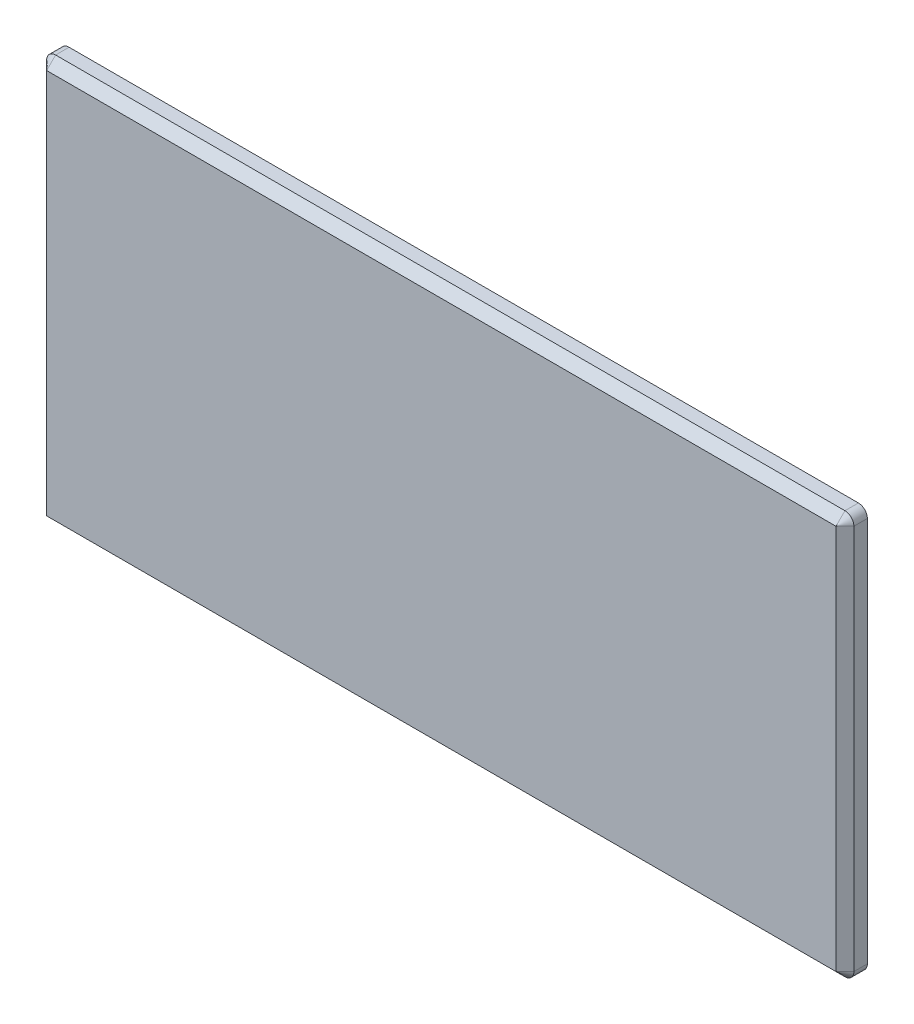
ISO-10303-21;
HEADER;
FILE_DESCRIPTION(('STEP AP214'),'2;1');
FILE_NAME('part.step','',(''),(''),'','','');
FILE_SCHEMA(('AUTOMOTIVE_DESIGN { 1 0 10303 214 1 1 1 1 }'));
ENDSEC;
DATA;
#1=APPLICATION_CONTEXT('core data for automotive mechanical design processes');
#2=APPLICATION_PROTOCOL_DEFINITION('international standard','automotive_design',2000,#1);
#3=PRODUCT_CONTEXT('',#1,'mechanical');
#4=PRODUCT('Part','Part','',(#3));
#5=PRODUCT_RELATED_PRODUCT_CATEGORY('part','',(#4));
#6=PRODUCT_DEFINITION_FORMATION('','',#4);
#7=PRODUCT_DEFINITION_CONTEXT('part definition',#1,'design');
#8=PRODUCT_DEFINITION('design','',#6,#7);
#9=PRODUCT_DEFINITION_SHAPE('','',#8);
#10=(LENGTH_UNIT() NAMED_UNIT(*) SI_UNIT(.MILLI.,.METRE.));
#11=(NAMED_UNIT(*) PLANE_ANGLE_UNIT() SI_UNIT($,.RADIAN.));
#12=(NAMED_UNIT(*) SI_UNIT($,.STERADIAN.) SOLID_ANGLE_UNIT());
#13=UNCERTAINTY_MEASURE_WITH_UNIT(LENGTH_MEASURE(1.E-05),#10,'distance_accuracy_value','');
#14=(GEOMETRIC_REPRESENTATION_CONTEXT(3) GLOBAL_UNCERTAINTY_ASSIGNED_CONTEXT((#13)) GLOBAL_UNIT_ASSIGNED_CONTEXT((#10,
#11,#12)) REPRESENTATION_CONTEXT('',''));
#15=CARTESIAN_POINT('',(0.,0.,0.));
#16=DIRECTION('',(0.,0.,1.));
#17=DIRECTION('',(1.,0.,0.));
#18=AXIS2_PLACEMENT_3D('',#15,#16,#17);
#19=CARTESIAN_POINT('',(45.,-22.5,2.5));
#20=DIRECTION('',(-1.,0.,0.));
#21=DIRECTION('',(0.,0.,1.));
#22=AXIS2_PLACEMENT_3D('',#19,#20,#21);
#23=PLANE('',#22);
#24=DIRECTION('',(0.,0.,-1.));
#25=VECTOR('',#24,1.);
#26=CARTESIAN_POINT('',(45.,21.5,2.5));
#27=LINE('',#26,#25);
#28=CARTESIAN_POINT('',(45.,21.5,0.));
#29=VERTEX_POINT('',#28);
#30=CARTESIAN_POINT('',(45.,21.5,1.5));
#31=VERTEX_POINT('',#30);
#32=EDGE_CURVE('E152',#29,#31,#27,.F.);
#33=ORIENTED_EDGE('',*,*,#32,.T.);
#34=DIRECTION('',(0.,-1.,0.));
#35=VECTOR('',#34,1.);
#36=CARTESIAN_POINT('',(45.,-22.5,1.5));
#37=LINE('',#36,#35);
#38=CARTESIAN_POINT('',(45.,-21.5,1.5));
#39=VERTEX_POINT('',#38);
#40=EDGE_CURVE('E171',#31,#39,#37,.T.);
#41=ORIENTED_EDGE('',*,*,#40,.T.);
#42=DIRECTION('',(0.,0.,-1.));
#43=VECTOR('',#42,1.);
#44=CARTESIAN_POINT('',(45.,-21.5,2.5));
#45=LINE('',#44,#43);
#46=CARTESIAN_POINT('',(45.,-21.5,0.));
#47=VERTEX_POINT('',#46);
#48=EDGE_CURVE('E150',#39,#47,#45,.T.);
#49=ORIENTED_EDGE('',*,*,#48,.T.);
#50=DIRECTION('',(0.,1.,0.));
#51=VECTOR('',#50,1.);
#52=CARTESIAN_POINT('',(45.,-22.5,0.));
#53=LINE('',#52,#51);
#54=EDGE_CURVE('E200',#47,#29,#53,.T.);
#55=ORIENTED_EDGE('',*,*,#54,.T.);
#56=EDGE_LOOP('',(#33,#41,#49,#55));
#57=FACE_BOUND('',#56,.T.);
#58=ADVANCED_FACE('F33',(#57),#23,.F.);
#59=CARTESIAN_POINT('',(-45.,22.5,2.5));
#60=DIRECTION('',(0.,-1.,0.));
#61=DIRECTION('',(0.,0.,-1.));
#62=AXIS2_PLACEMENT_3D('',#59,#60,#61);
#63=PLANE('',#62);
#64=DIRECTION('',(0.,0.,-1.));
#65=VECTOR('',#64,1.);
#66=CARTESIAN_POINT('',(-44.,22.5,2.5));
#67=LINE('',#66,#65);
#68=CARTESIAN_POINT('',(-44.,22.5,0.));
#69=VERTEX_POINT('',#68);
#70=CARTESIAN_POINT('',(-44.,22.5,1.5));
#71=VERTEX_POINT('',#70);
#72=EDGE_CURVE('E147',#69,#71,#67,.F.);
#73=ORIENTED_EDGE('',*,*,#72,.T.);
#74=DIRECTION('',(1.,0.,0.));
#75=VECTOR('',#74,1.);
#76=CARTESIAN_POINT('',(-45.,22.5,1.5));
#77=LINE('',#76,#75);
#78=CARTESIAN_POINT('',(44.,22.5,1.5));
#79=VERTEX_POINT('',#78);
#80=EDGE_CURVE('E167',#71,#79,#77,.T.);
#81=ORIENTED_EDGE('',*,*,#80,.T.);
#82=DIRECTION('',(0.,0.,-1.));
#83=VECTOR('',#82,1.);
#84=CARTESIAN_POINT('',(44.,22.5,2.5));
#85=LINE('',#84,#83);
#86=CARTESIAN_POINT('',(44.,22.5,0.));
#87=VERTEX_POINT('',#86);
#88=EDGE_CURVE('E145',#79,#87,#85,.T.);
#89=ORIENTED_EDGE('',*,*,#88,.T.);
#90=DIRECTION('',(-1.,0.,0.));
#91=VECTOR('',#90,1.);
#92=CARTESIAN_POINT('',(-45.,22.5,0.));
#93=LINE('',#92,#91);
#94=EDGE_CURVE('E135',#87,#69,#93,.T.);
#95=ORIENTED_EDGE('',*,*,#94,.T.);
#96=EDGE_LOOP('',(#73,#81,#89,#95));
#97=FACE_BOUND('',#96,.T.);
#98=ADVANCED_FACE('F254',(#97),#63,.F.);
#99=CARTESIAN_POINT('',(-45.,-22.5,2.5));
#100=DIRECTION('',(1.,0.,0.));
#101=DIRECTION('',(0.,0.,-1.));
#102=AXIS2_PLACEMENT_3D('',#99,#100,#101);
#103=PLANE('',#102);
#104=DIRECTION('',(0.,0.,-1.));
#105=VECTOR('',#104,1.);
#106=CARTESIAN_POINT('',(-45.,-21.5,2.5));
#107=LINE('',#106,#105);
#108=CARTESIAN_POINT('',(-45.,-21.5,0.));
#109=VERTEX_POINT('',#108);
#110=CARTESIAN_POINT('',(-45.,-21.5,1.5));
#111=VERTEX_POINT('',#110);
#112=EDGE_CURVE('E122',#109,#111,#107,.F.);
#113=ORIENTED_EDGE('',*,*,#112,.T.);
#114=DIRECTION('',(0.,1.,0.));
#115=VECTOR('',#114,1.);
#116=CARTESIAN_POINT('',(-45.,-22.5,1.5));
#117=LINE('',#116,#115);
#118=CARTESIAN_POINT('',(-45.,21.5,1.5));
#119=VERTEX_POINT('',#118);
#120=EDGE_CURVE('E11',#111,#119,#117,.T.);
#121=ORIENTED_EDGE('',*,*,#120,.T.);
#122=DIRECTION('',(0.,0.,-1.));
#123=VECTOR('',#122,1.);
#124=CARTESIAN_POINT('',(-45.,21.5,2.5));
#125=LINE('',#124,#123);
#126=CARTESIAN_POINT('',(-45.,21.5,0.));
#127=VERTEX_POINT('',#126);
#128=EDGE_CURVE('E126',#119,#127,#125,.T.);
#129=ORIENTED_EDGE('',*,*,#128,.T.);
#130=DIRECTION('',(0.,-1.,0.));
#131=VECTOR('',#130,1.);
#132=CARTESIAN_POINT('',(-45.,-22.5,0.));
#133=LINE('',#132,#131);
#134=EDGE_CURVE('E132',#127,#109,#133,.T.);
#135=ORIENTED_EDGE('',*,*,#134,.T.);
#136=EDGE_LOOP('',(#113,#121,#129,#135));
#137=FACE_BOUND('',#136,.T.);
#138=ADVANCED_FACE('F259',(#137),#103,.F.);
#139=CARTESIAN_POINT('',(-45.,-22.5,2.5));
#140=DIRECTION('',(0.,1.,0.));
#141=DIRECTION('',(0.,0.,1.));
#142=AXIS2_PLACEMENT_3D('',#139,#140,#141);
#143=PLANE('',#142);
#144=DIRECTION('',(0.,0.,-1.));
#145=VECTOR('',#144,1.);
#146=CARTESIAN_POINT('',(44.,-22.5,2.5));
#147=LINE('',#146,#145);
#148=CARTESIAN_POINT('',(44.,-22.5,0.));
#149=VERTEX_POINT('',#148);
#150=CARTESIAN_POINT('',(44.,-22.5,1.5));
#151=VERTEX_POINT('',#150);
#152=EDGE_CURVE('E118',#149,#151,#147,.F.);
#153=ORIENTED_EDGE('',*,*,#152,.T.);
#154=DIRECTION('',(-1.,0.,0.));
#155=VECTOR('',#154,1.);
#156=CARTESIAN_POINT('',(-45.,-22.5,1.5));
#157=LINE('',#156,#155);
#158=CARTESIAN_POINT('',(-44.,-22.5,1.5));
#159=VERTEX_POINT('',#158);
#160=EDGE_CURVE('E57',#151,#159,#157,.T.);
#161=ORIENTED_EDGE('',*,*,#160,.T.);
#162=DIRECTION('',(0.,0.,-1.));
#163=VECTOR('',#162,1.);
#164=CARTESIAN_POINT('',(-44.,-22.5,2.5));
#165=LINE('',#164,#163);
#166=CARTESIAN_POINT('',(-44.,-22.5,0.));
#167=VERTEX_POINT('',#166);
#168=EDGE_CURVE('E110',#159,#167,#165,.T.);
#169=ORIENTED_EDGE('',*,*,#168,.T.);
#170=DIRECTION('',(1.,0.,0.));
#171=VECTOR('',#170,1.);
#172=CARTESIAN_POINT('',(-45.,-22.5,0.));
#173=LINE('',#172,#171);
#174=EDGE_CURVE('E114',#167,#149,#173,.T.);
#175=ORIENTED_EDGE('',*,*,#174,.T.);
#176=EDGE_LOOP('',(#153,#161,#169,#175));
#177=FACE_BOUND('',#176,.T.);
#178=ADVANCED_FACE('F112',(#177),#143,.F.);
#179=CARTESIAN_POINT('',(0.,0.,2.5));
#180=DIRECTION('',(0.,0.,-1.));
#181=DIRECTION('',(-1.,0.,0.));
#182=AXIS2_PLACEMENT_3D('',#179,#180,#181);
#183=PLANE('',#182);
#184=DIRECTION('',(0.,1.,0.));
#185=VECTOR('',#184,1.);
#186=CARTESIAN_POINT('',(44.,0.,2.5));
#187=LINE('',#186,#185);
#188=CARTESIAN_POINT('',(44.,-21.5,2.5));
#189=VERTEX_POINT('',#188);
#190=CARTESIAN_POINT('',(44.,21.5,2.5));
#191=VERTEX_POINT('',#190);
#192=EDGE_CURVE('E162',#189,#191,#187,.T.);
#193=ORIENTED_EDGE('',*,*,#192,.T.);
#194=DIRECTION('',(-1.,0.,0.));
#195=VECTOR('',#194,1.);
#196=CARTESIAN_POINT('',(0.,21.5,2.5));
#197=LINE('',#196,#195);
#198=CARTESIAN_POINT('',(-44.,21.5,2.5));
#199=VERTEX_POINT('',#198);
#200=EDGE_CURVE('E164',#191,#199,#197,.T.);
#201=ORIENTED_EDGE('',*,*,#200,.T.);
#202=DIRECTION('',(0.,-1.,0.));
#203=VECTOR('',#202,1.);
#204=CARTESIAN_POINT('',(-44.,0.,2.5));
#205=LINE('',#204,#203);
#206=CARTESIAN_POINT('',(-44.,-21.5,2.5));
#207=VERTEX_POINT('',#206);
#208=EDGE_CURVE('E158',#199,#207,#205,.T.);
#209=ORIENTED_EDGE('',*,*,#208,.T.);
#210=DIRECTION('',(1.,0.,0.));
#211=VECTOR('',#210,1.);
#212=CARTESIAN_POINT('',(0.,-21.5,2.5));
#213=LINE('',#212,#211);
#214=EDGE_CURVE('E160',#207,#189,#213,.T.);
#215=ORIENTED_EDGE('',*,*,#214,.T.);
#216=EDGE_LOOP('',(#193,#201,#209,#215));
#217=FACE_BOUND('',#216,.T.);
#218=ADVANCED_FACE('F233',(#217),#183,.F.);
#219=CARTESIAN_POINT('',(0.,0.,0.));
#220=DIRECTION('',(0.,0.,-1.));
#221=DIRECTION('',(-1.,0.,0.));
#222=AXIS2_PLACEMENT_3D('',#219,#220,#221);
#223=PLANE('',#222);
#224=CARTESIAN_POINT('',(-22.5,0.,0.));
#225=DIRECTION('',(0.,0.,-1.));
#226=DIRECTION('',(-1.,0.,0.));
#227=AXIS2_PLACEMENT_3D('',#224,#225,#226);
#228=CIRCLE('',#227,4.);
#229=CARTESIAN_POINT('',(-26.5,0.,0.));
#230=VERTEX_POINT('',#229);
#231=EDGE_CURVE('E216',#230,#230,#228,.T.);
#232=ORIENTED_EDGE('',*,*,#231,.F.);
#233=EDGE_LOOP('',(#232));
#234=FACE_BOUND('',#233,.T.);
#235=CARTESIAN_POINT('',(22.5,0.,0.));
#236=DIRECTION('',(0.,0.,-1.));
#237=DIRECTION('',(-1.,0.,0.));
#238=AXIS2_PLACEMENT_3D('',#235,#236,#237);
#239=CIRCLE('',#238,4.);
#240=CARTESIAN_POINT('',(18.5,0.,0.));
#241=VERTEX_POINT('',#240);
#242=EDGE_CURVE('E210',#241,#241,#239,.T.);
#243=ORIENTED_EDGE('',*,*,#242,.F.);
#244=EDGE_LOOP('',(#243));
#245=FACE_BOUND('',#244,.T.);
#246=ORIENTED_EDGE('',*,*,#174,.F.);
#247=CARTESIAN_POINT('',(-44.,-21.5,0.));
#248=DIRECTION('',(0.,0.,-1.));
#249=DIRECTION('',(-1.,0.,0.));
#250=AXIS2_PLACEMENT_3D('',#247,#248,#249);
#251=CIRCLE('',#250,1.);
#252=EDGE_CURVE('E120',#167,#109,#251,.T.);
#253=ORIENTED_EDGE('',*,*,#252,.T.);
#254=ORIENTED_EDGE('',*,*,#134,.F.);
#255=CARTESIAN_POINT('',(-44.,21.5,0.));
#256=DIRECTION('',(0.,0.,-1.));
#257=DIRECTION('',(-1.,0.,0.));
#258=AXIS2_PLACEMENT_3D('',#255,#256,#257);
#259=CIRCLE('',#258,1.);
#260=EDGE_CURVE('E127',#127,#69,#259,.T.);
#261=ORIENTED_EDGE('',*,*,#260,.T.);
#262=ORIENTED_EDGE('',*,*,#94,.F.);
#263=CARTESIAN_POINT('',(44.,21.5,0.));
#264=DIRECTION('',(0.,0.,-1.));
#265=DIRECTION('',(-1.,0.,0.));
#266=AXIS2_PLACEMENT_3D('',#263,#264,#265);
#267=CIRCLE('',#266,1.);
#268=EDGE_CURVE('E140',#87,#29,#267,.T.);
#269=ORIENTED_EDGE('',*,*,#268,.T.);
#270=ORIENTED_EDGE('',*,*,#54,.F.);
#271=CARTESIAN_POINT('',(44.,-21.5,0.));
#272=DIRECTION('',(0.,0.,-1.));
#273=DIRECTION('',(-1.,0.,0.));
#274=AXIS2_PLACEMENT_3D('',#271,#272,#273);
#275=CIRCLE('',#274,1.);
#276=EDGE_CURVE('E117',#47,#149,#275,.T.);
#277=ORIENTED_EDGE('',*,*,#276,.T.);
#278=EDGE_LOOP('',(#246,#253,#254,#261,#262,#269,#270,#277));
#279=FACE_BOUND('',#278,.T.);
#280=ADVANCED_FACE('F129',(#234,#245,#279),#223,.T.);
#281=CARTESIAN_POINT('',(-44.,-21.5,2.5));
#282=DIRECTION('',(0.,0.,-1.));
#283=DIRECTION('',(-1.,0.,0.));
#284=AXIS2_PLACEMENT_3D('',#281,#282,#283);
#285=CYLINDRICAL_SURFACE('',#284,1.);
#286=ORIENTED_EDGE('',*,*,#168,.F.);
#287=CARTESIAN_POINT('',(-44.,-21.5,1.5));
#288=DIRECTION('',(0.,0.,-1.));
#289=DIRECTION('',(-1.,0.,0.));
#290=AXIS2_PLACEMENT_3D('',#287,#288,#289);
#291=CIRCLE('',#290,1.);
#292=EDGE_CURVE('E42',#159,#111,#291,.T.);
#293=ORIENTED_EDGE('',*,*,#292,.T.);
#294=ORIENTED_EDGE('',*,*,#112,.F.);
#295=ORIENTED_EDGE('',*,*,#252,.F.);
#296=EDGE_LOOP('',(#286,#293,#294,#295));
#297=FACE_BOUND('',#296,.T.);
#298=ADVANCED_FACE('F121',(#297),#285,.T.);
#299=CARTESIAN_POINT('',(-44.,21.5,2.5));
#300=DIRECTION('',(0.,0.,-1.));
#301=DIRECTION('',(-1.,0.,0.));
#302=AXIS2_PLACEMENT_3D('',#299,#300,#301);
#303=CYLINDRICAL_SURFACE('',#302,1.);
#304=ORIENTED_EDGE('',*,*,#128,.F.);
#305=CARTESIAN_POINT('',(-44.,21.5,1.5));
#306=DIRECTION('',(0.,0.,-1.));
#307=DIRECTION('',(-1.,0.,0.));
#308=AXIS2_PLACEMENT_3D('',#305,#306,#307);
#309=CIRCLE('',#308,1.);
#310=EDGE_CURVE('E155',#119,#71,#309,.T.);
#311=ORIENTED_EDGE('',*,*,#310,.T.);
#312=ORIENTED_EDGE('',*,*,#72,.F.);
#313=ORIENTED_EDGE('',*,*,#260,.F.);
#314=EDGE_LOOP('',(#304,#311,#312,#313));
#315=FACE_BOUND('',#314,.T.);
#316=ADVANCED_FACE('F266',(#315),#303,.T.);
#317=CARTESIAN_POINT('',(44.,21.5,2.5));
#318=DIRECTION('',(0.,0.,-1.));
#319=DIRECTION('',(-1.,0.,0.));
#320=AXIS2_PLACEMENT_3D('',#317,#318,#319);
#321=CYLINDRICAL_SURFACE('',#320,1.);
#322=ORIENTED_EDGE('',*,*,#88,.F.);
#323=CARTESIAN_POINT('',(44.,21.5,1.5));
#324=DIRECTION('',(0.,0.,-1.));
#325=DIRECTION('',(-1.,0.,0.));
#326=AXIS2_PLACEMENT_3D('',#323,#324,#325);
#327=CIRCLE('',#326,1.);
#328=EDGE_CURVE('E169',#79,#31,#327,.T.);
#329=ORIENTED_EDGE('',*,*,#328,.T.);
#330=ORIENTED_EDGE('',*,*,#32,.F.);
#331=ORIENTED_EDGE('',*,*,#268,.F.);
#332=EDGE_LOOP('',(#322,#329,#330,#331));
#333=FACE_BOUND('',#332,.T.);
#334=ADVANCED_FACE('F269',(#333),#321,.T.);
#335=CARTESIAN_POINT('',(44.,-21.5,2.5));
#336=DIRECTION('',(0.,0.,-1.));
#337=DIRECTION('',(-1.,0.,0.));
#338=AXIS2_PLACEMENT_3D('',#335,#336,#337);
#339=CYLINDRICAL_SURFACE('',#338,1.);
#340=ORIENTED_EDGE('',*,*,#48,.F.);
#341=CARTESIAN_POINT('',(44.,-21.5,1.5));
#342=DIRECTION('',(0.,0.,-1.));
#343=DIRECTION('',(-1.,0.,0.));
#344=AXIS2_PLACEMENT_3D('',#341,#342,#343);
#345=CIRCLE('',#344,1.);
#346=EDGE_CURVE('E173',#39,#151,#345,.T.);
#347=ORIENTED_EDGE('',*,*,#346,.T.);
#348=ORIENTED_EDGE('',*,*,#152,.F.);
#349=ORIENTED_EDGE('',*,*,#276,.F.);
#350=EDGE_LOOP('',(#340,#347,#348,#349));
#351=FACE_BOUND('',#350,.T.);
#352=ADVANCED_FACE('F273',(#351),#339,.T.);
#353=CARTESIAN_POINT('',(44.,-21.5,1.5));
#354=DIRECTION('',(0.,0.,-1.));
#355=DIRECTION('',(-1.,0.,0.));
#356=AXIS2_PLACEMENT_3D('',#353,#354,#355);
#357=CONICAL_SURFACE('',#356,0.999999999999987,0.785398163397442);
#358=DIRECTION('',(0.,0.707106781186543,0.707106781186552));
#359=VECTOR('',#358,1.);
#360=CARTESIAN_POINT('',(44.,-22.5,1.5));
#361=LINE('',#360,#359);
#362=EDGE_CURVE('E193',#151,#189,#361,.T.);
#363=ORIENTED_EDGE('',*,*,#362,.F.);
#364=ORIENTED_EDGE('',*,*,#346,.F.);
#365=DIRECTION('',(0.707106781186543,0.,-0.707106781186552));
#366=VECTOR('',#365,1.);
#367=CARTESIAN_POINT('',(44.,-21.5,2.5));
#368=LINE('',#367,#366);
#369=EDGE_CURVE('E37',#189,#39,#368,.T.);
#370=ORIENTED_EDGE('',*,*,#369,.F.);
#371=EDGE_LOOP('',(#363,#364,#370));
#372=FACE_BOUND('',#371,.T.);
#373=ADVANCED_FACE('F35',(#372),#357,.T.);
#374=CARTESIAN_POINT('',(44.,0.,2.5));
#375=DIRECTION('',(-0.707106781186552,0.,-0.707106781186543));
#376=DIRECTION('',(0.,1.,0.));
#377=AXIS2_PLACEMENT_3D('',#374,#375,#376);
#378=PLANE('',#377);
#379=ORIENTED_EDGE('',*,*,#369,.T.);
#380=ORIENTED_EDGE('',*,*,#40,.F.);
#381=DIRECTION('',(0.707106781186543,0.,-0.707106781186552));
#382=VECTOR('',#381,1.);
#383=CARTESIAN_POINT('',(44.,21.5,2.5));
#384=LINE('',#383,#382);
#385=EDGE_CURVE('E191',#191,#31,#384,.T.);
#386=ORIENTED_EDGE('',*,*,#385,.F.);
#387=ORIENTED_EDGE('',*,*,#192,.F.);
#388=EDGE_LOOP('',(#379,#380,#386,#387));
#389=FACE_BOUND('',#388,.T.);
#390=ADVANCED_FACE('F295',(#389),#378,.F.);
#391=CARTESIAN_POINT('',(0.,-21.5,2.5));
#392=DIRECTION('',(0.,0.707106781186552,-0.707106781186543));
#393=DIRECTION('',(1.,0.,0.));
#394=AXIS2_PLACEMENT_3D('',#391,#392,#393);
#395=PLANE('',#394);
#396=ORIENTED_EDGE('',*,*,#362,.T.);
#397=ORIENTED_EDGE('',*,*,#214,.F.);
#398=DIRECTION('',(0.,0.707106781186543,0.707106781186552));
#399=VECTOR('',#398,1.);
#400=CARTESIAN_POINT('',(-44.,-22.5,1.5));
#401=LINE('',#400,#399);
#402=EDGE_CURVE('E188',#159,#207,#401,.T.);
#403=ORIENTED_EDGE('',*,*,#402,.F.);
#404=ORIENTED_EDGE('',*,*,#160,.F.);
#405=EDGE_LOOP('',(#396,#397,#403,#404));
#406=FACE_BOUND('',#405,.T.);
#407=ADVANCED_FACE('F292',(#406),#395,.F.);
#408=CARTESIAN_POINT('',(44.,21.5,1.5));
#409=DIRECTION('',(0.,0.,-1.));
#410=DIRECTION('',(-1.,0.,0.));
#411=AXIS2_PLACEMENT_3D('',#408,#409,#410);
#412=CONICAL_SURFACE('',#411,0.999999999999987,0.785398163397442);
#413=ORIENTED_EDGE('',*,*,#385,.T.);
#414=ORIENTED_EDGE('',*,*,#328,.F.);
#415=DIRECTION('',(0.,0.707106781186543,-0.707106781186552));
#416=VECTOR('',#415,1.);
#417=CARTESIAN_POINT('',(44.,21.5,2.5));
#418=LINE('',#417,#416);
#419=EDGE_CURVE('E185',#191,#79,#418,.T.);
#420=ORIENTED_EDGE('',*,*,#419,.F.);
#421=EDGE_LOOP('',(#413,#414,#420));
#422=FACE_BOUND('',#421,.T.);
#423=ADVANCED_FACE('F288',(#422),#412,.T.);
#424=CARTESIAN_POINT('',(-44.,-21.5,1.5));
#425=DIRECTION('',(0.,0.,-1.));
#426=DIRECTION('',(-1.,0.,0.));
#427=AXIS2_PLACEMENT_3D('',#424,#425,#426);
#428=CONICAL_SURFACE('',#427,0.999999999999987,0.785398163397442);
#429=ORIENTED_EDGE('',*,*,#292,.F.);
#430=ORIENTED_EDGE('',*,*,#402,.T.);
#431=DIRECTION('',(0.707106781186543,0.,0.707106781186552));
#432=VECTOR('',#431,1.);
#433=CARTESIAN_POINT('',(-45.,-21.5,1.5));
#434=LINE('',#433,#432);
#435=EDGE_CURVE('E182',#111,#207,#434,.T.);
#436=ORIENTED_EDGE('',*,*,#435,.F.);
#437=EDGE_LOOP('',(#429,#430,#436));
#438=FACE_BOUND('',#437,.T.);
#439=ADVANCED_FACE('F284',(#438),#428,.T.);
#440=CARTESIAN_POINT('',(0.,21.5,2.5));
#441=DIRECTION('',(0.,-0.707106781186552,-0.707106781186543));
#442=DIRECTION('',(-1.,0.,0.));
#443=AXIS2_PLACEMENT_3D('',#440,#441,#442);
#444=PLANE('',#443);
#445=ORIENTED_EDGE('',*,*,#419,.T.);
#446=ORIENTED_EDGE('',*,*,#80,.F.);
#447=DIRECTION('',(0.,0.707106781186543,-0.707106781186552));
#448=VECTOR('',#447,1.);
#449=CARTESIAN_POINT('',(-44.,21.5,2.5));
#450=LINE('',#449,#448);
#451=EDGE_CURVE('E179',#199,#71,#450,.T.);
#452=ORIENTED_EDGE('',*,*,#451,.F.);
#453=ORIENTED_EDGE('',*,*,#200,.F.);
#454=EDGE_LOOP('',(#445,#446,#452,#453));
#455=FACE_BOUND('',#454,.T.);
#456=ADVANCED_FACE('F280',(#455),#444,.F.);
#457=CARTESIAN_POINT('',(-44.,0.,2.5));
#458=DIRECTION('',(0.707106781186552,0.,-0.707106781186543));
#459=DIRECTION('',(0.,-1.,0.));
#460=AXIS2_PLACEMENT_3D('',#457,#458,#459);
#461=PLANE('',#460);
#462=ORIENTED_EDGE('',*,*,#435,.T.);
#463=ORIENTED_EDGE('',*,*,#208,.F.);
#464=DIRECTION('',(0.707106781186543,0.,0.707106781186552));
#465=VECTOR('',#464,1.);
#466=CARTESIAN_POINT('',(-45.,21.5,1.5));
#467=LINE('',#466,#465);
#468=EDGE_CURVE('E177',#119,#199,#467,.T.);
#469=ORIENTED_EDGE('',*,*,#468,.F.);
#470=ORIENTED_EDGE('',*,*,#120,.F.);
#471=EDGE_LOOP('',(#462,#463,#469,#470));
#472=FACE_BOUND('',#471,.T.);
#473=ADVANCED_FACE('F248',(#472),#461,.F.);
#474=CARTESIAN_POINT('',(-44.,21.5,1.5));
#475=DIRECTION('',(0.,0.,-1.));
#476=DIRECTION('',(-1.,0.,0.));
#477=AXIS2_PLACEMENT_3D('',#474,#475,#476);
#478=CONICAL_SURFACE('',#477,0.999999999999987,0.785398163397442);
#479=ORIENTED_EDGE('',*,*,#451,.T.);
#480=ORIENTED_EDGE('',*,*,#310,.F.);
#481=ORIENTED_EDGE('',*,*,#468,.T.);
#482=EDGE_LOOP('',(#479,#480,#481));
#483=FACE_BOUND('',#482,.T.);
#484=ADVANCED_FACE('F239',(#483),#478,.T.);
#485=CARTESIAN_POINT('',(22.5,0.,-10.));
#486=DIRECTION('',(0.,0.,1.));
#487=DIRECTION('',(1.,0.,0.));
#488=AXIS2_PLACEMENT_3D('',#485,#486,#487);
#489=CYLINDRICAL_SURFACE('',#488,4.);
#490=CARTESIAN_POINT('',(22.5,0.,-10.));
#491=DIRECTION('',(0.,0.,-1.));
#492=DIRECTION('',(-1.,0.,0.));
#493=AXIS2_PLACEMENT_3D('',#490,#491,#492);
#494=CIRCLE('',#493,4.);
#495=CARTESIAN_POINT('',(18.5,0.,-10.));
#496=VERTEX_POINT('',#495);
#497=EDGE_CURVE('E180',#496,#496,#494,.T.);
#498=ORIENTED_EDGE('',*,*,#497,.F.);
#499=EDGE_LOOP('',(#498));
#500=FACE_BOUND('',#499,.T.);
#501=ORIENTED_EDGE('',*,*,#242,.T.);
#502=EDGE_LOOP('',(#501));
#503=FACE_BOUND('',#502,.T.);
#504=ADVANCED_FACE('F237',(#500,#503),#489,.T.);
#505=CARTESIAN_POINT('',(22.5,0.,-10.));
#506=DIRECTION('',(0.,0.,-1.));
#507=DIRECTION('',(-1.,0.,0.));
#508=AXIS2_PLACEMENT_3D('',#505,#506,#507);
#509=PLANE('',#508);
#510=ORIENTED_EDGE('',*,*,#497,.T.);
#511=EDGE_LOOP('',(#510));
#512=FACE_BOUND('',#511,.T.);
#513=ADVANCED_FACE('F227',(#512),#509,.T.);
#514=CARTESIAN_POINT('',(-22.5,0.,-10.));
#515=DIRECTION('',(0.,0.,1.));
#516=DIRECTION('',(1.,0.,0.));
#517=AXIS2_PLACEMENT_3D('',#514,#515,#516);
#518=CYLINDRICAL_SURFACE('',#517,4.);
#519=CARTESIAN_POINT('',(-22.5,0.,-10.));
#520=DIRECTION('',(0.,0.,-1.));
#521=DIRECTION('',(-1.,0.,0.));
#522=AXIS2_PLACEMENT_3D('',#519,#520,#521);
#523=CIRCLE('',#522,4.);
#524=CARTESIAN_POINT('',(-26.5,0.,-10.));
#525=VERTEX_POINT('',#524);
#526=EDGE_CURVE('E213',#525,#525,#523,.T.);
#527=ORIENTED_EDGE('',*,*,#526,.F.);
#528=EDGE_LOOP('',(#527));
#529=FACE_BOUND('',#528,.T.);
#530=ORIENTED_EDGE('',*,*,#231,.T.);
#531=EDGE_LOOP('',(#530));
#532=FACE_BOUND('',#531,.T.);
#533=ADVANCED_FACE('F224',(#529,#532),#518,.T.);
#534=CARTESIAN_POINT('',(-22.5,0.,-10.));
#535=DIRECTION('',(0.,0.,-1.));
#536=DIRECTION('',(-1.,0.,0.));
#537=AXIS2_PLACEMENT_3D('',#534,#535,#536);
#538=PLANE('',#537);
#539=ORIENTED_EDGE('',*,*,#526,.T.);
#540=EDGE_LOOP('',(#539));
#541=FACE_BOUND('',#540,.T.);
#542=ADVANCED_FACE('F222',(#541),#538,.T.);
#543=CLOSED_SHELL('',(#58,#98,#138,#178,#218,#280,#298,#316,#334,#352,#373,#390,#407,#423,#439,
#456,#473,#484,#504,#513,#533,#542));
#544=MANIFOLD_SOLID_BREP('B2',#543);
#545=ADVANCED_BREP_SHAPE_REPRESENTATION('',(#18,#544),#14);
#546=SHAPE_DEFINITION_REPRESENTATION(#9,#545);
ENDSEC;
END-ISO-10303-21;
